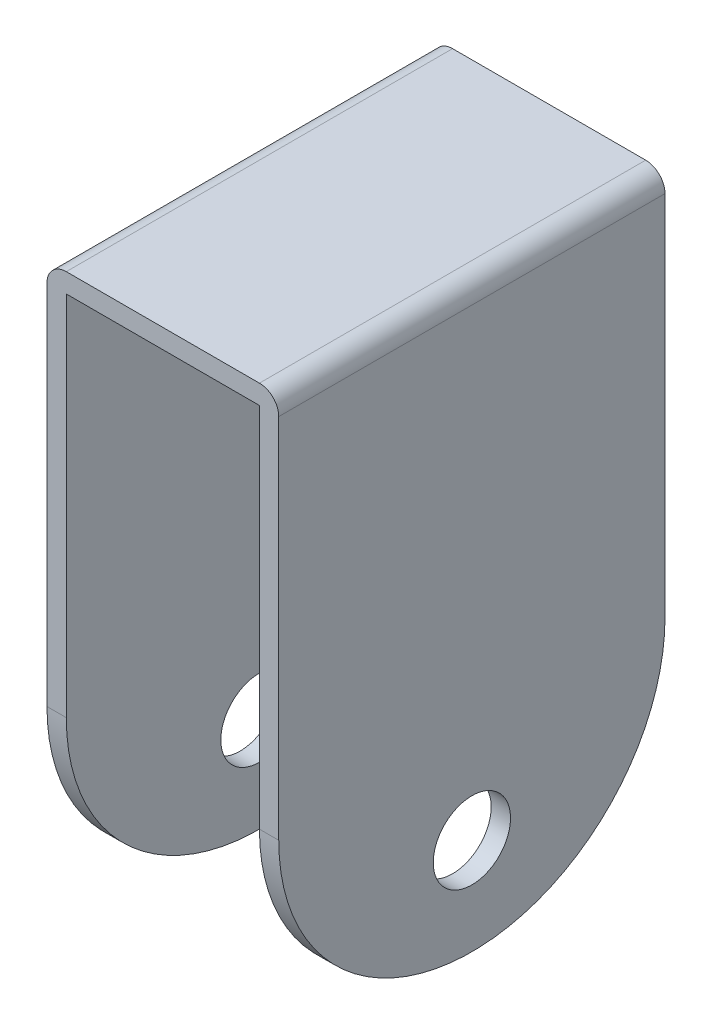
ISO-10303-21;
HEADER;
FILE_DESCRIPTION(('STEP AP214'),'2;1');
FILE_NAME('part.step','',(''),(''),'','','');
FILE_SCHEMA(('AUTOMOTIVE_DESIGN { 1 0 10303 214 1 1 1 1 }'));
ENDSEC;
DATA;
#1=APPLICATION_CONTEXT('core data for automotive mechanical design processes');
#2=APPLICATION_PROTOCOL_DEFINITION('international standard','automotive_design',2000,#1);
#3=PRODUCT_CONTEXT('',#1,'mechanical');
#4=PRODUCT('Part','Part','',(#3));
#5=PRODUCT_RELATED_PRODUCT_CATEGORY('part','',(#4));
#6=PRODUCT_DEFINITION_FORMATION('','',#4);
#7=PRODUCT_DEFINITION_CONTEXT('part definition',#1,'design');
#8=PRODUCT_DEFINITION('design','',#6,#7);
#9=PRODUCT_DEFINITION_SHAPE('','',#8);
#10=(LENGTH_UNIT() NAMED_UNIT(*) SI_UNIT(.MILLI.,.METRE.));
#11=(NAMED_UNIT(*) PLANE_ANGLE_UNIT() SI_UNIT($,.RADIAN.));
#12=(NAMED_UNIT(*) SI_UNIT($,.STERADIAN.) SOLID_ANGLE_UNIT());
#13=UNCERTAINTY_MEASURE_WITH_UNIT(LENGTH_MEASURE(1.E-05),#10,'distance_accuracy_value','');
#14=(GEOMETRIC_REPRESENTATION_CONTEXT(3) GLOBAL_UNCERTAINTY_ASSIGNED_CONTEXT((#13)) GLOBAL_UNIT_ASSIGNED_CONTEXT((#10,
#11,#12)) REPRESENTATION_CONTEXT('',''));
#15=CARTESIAN_POINT('',(0.,0.,0.));
#16=DIRECTION('',(0.,0.,1.));
#17=DIRECTION('',(1.,0.,0.));
#18=AXIS2_PLACEMENT_3D('',#15,#16,#17);
#19=CARTESIAN_POINT('',(-3.,0.,0.));
#20=DIRECTION('',(0.,0.,1.));
#21=DIRECTION('',(0.,-1.,0.));
#22=AXIS2_PLACEMENT_3D('',#19,#20,#21);
#23=PLANE('',#22);
#24=DIRECTION('',(0.,-1.,0.));
#25=VECTOR('',#24,1.);
#26=CARTESIAN_POINT('',(0.,0.,0.));
#27=LINE('',#26,#25);
#28=CARTESIAN_POINT('',(0.,-3.,0.));
#29=VERTEX_POINT('',#28);
#30=CARTESIAN_POINT('',(0.,-60.,0.));
#31=VERTEX_POINT('',#30);
#32=EDGE_CURVE('E155',#29,#31,#27,.T.);
#33=ORIENTED_EDGE('',*,*,#32,.F.);
#34=CARTESIAN_POINT('',(-3.,-3.,0.));
#35=DIRECTION('',(0.,0.,1.));
#36=DIRECTION('',(0.,-1.,0.));
#37=AXIS2_PLACEMENT_3D('',#34,#35,#36);
#38=CIRCLE('',#37,3.);
#39=CARTESIAN_POINT('',(-3.,0.,0.));
#40=VERTEX_POINT('',#39);
#41=EDGE_CURVE('E187',#29,#40,#38,.T.);
#42=ORIENTED_EDGE('',*,*,#41,.T.);
#43=DIRECTION('',(1.,0.,0.));
#44=VECTOR('',#43,1.);
#45=CARTESIAN_POINT('',(-3.,0.,0.));
#46=LINE('',#45,#44);
#47=CARTESIAN_POINT('',(-33.,0.,0.));
#48=VERTEX_POINT('',#47);
#49=EDGE_CURVE('E174',#48,#40,#46,.T.);
#50=ORIENTED_EDGE('',*,*,#49,.F.);
#51=CARTESIAN_POINT('',(-33.,-3.,0.));
#52=DIRECTION('',(0.,0.,1.));
#53=DIRECTION('',(0.,-1.,0.));
#54=AXIS2_PLACEMENT_3D('',#51,#52,#53);
#55=CIRCLE('',#54,3.);
#56=CARTESIAN_POINT('',(-36.,-3.,0.));
#57=VERTEX_POINT('',#56);
#58=EDGE_CURVE('E185',#48,#57,#55,.T.);
#59=ORIENTED_EDGE('',*,*,#58,.T.);
#60=DIRECTION('',(0.,1.,0.));
#61=VECTOR('',#60,1.);
#62=CARTESIAN_POINT('',(-36.,0.,0.));
#63=LINE('',#62,#61);
#64=CARTESIAN_POINT('',(-36.,-60.,0.));
#65=VERTEX_POINT('',#64);
#66=EDGE_CURVE('E128',#65,#57,#63,.T.);
#67=ORIENTED_EDGE('',*,*,#66,.F.);
#68=DIRECTION('',(1.,0.,0.));
#69=VECTOR('',#68,1.);
#70=CARTESIAN_POINT('',(-36.,-60.,0.));
#71=LINE('',#70,#69);
#72=CARTESIAN_POINT('',(-33.,-60.,0.));
#73=VERTEX_POINT('',#72);
#74=EDGE_CURVE('E126',#65,#73,#71,.T.);
#75=ORIENTED_EDGE('',*,*,#74,.T.);
#76=DIRECTION('',(0.,1.,0.));
#77=VECTOR('',#76,1.);
#78=CARTESIAN_POINT('',(-33.,0.,0.));
#79=LINE('',#78,#77);
#80=CARTESIAN_POINT('',(-33.,-3.,0.));
#81=VERTEX_POINT('',#80);
#82=EDGE_CURVE('E119',#73,#81,#79,.T.);
#83=ORIENTED_EDGE('',*,*,#82,.T.);
#84=DIRECTION('',(1.,0.,0.));
#85=VECTOR('',#84,1.);
#86=CARTESIAN_POINT('',(-33.,-3.,0.));
#87=LINE('',#86,#85);
#88=CARTESIAN_POINT('',(-3.,-3.,0.));
#89=VERTEX_POINT('',#88);
#90=EDGE_CURVE('E144',#81,#89,#87,.T.);
#91=ORIENTED_EDGE('',*,*,#90,.T.);
#92=DIRECTION('',(0.,-1.,0.));
#93=VECTOR('',#92,1.);
#94=CARTESIAN_POINT('',(-3.,0.,0.));
#95=LINE('',#94,#93);
#96=CARTESIAN_POINT('',(-3.,-60.,0.));
#97=VERTEX_POINT('',#96);
#98=EDGE_CURVE('E158',#89,#97,#95,.T.);
#99=ORIENTED_EDGE('',*,*,#98,.T.);
#100=DIRECTION('',(1.,0.,0.));
#101=VECTOR('',#100,1.);
#102=CARTESIAN_POINT('',(-3.,-60.,0.));
#103=LINE('',#102,#101);
#104=EDGE_CURVE('E167',#97,#31,#103,.T.);
#105=ORIENTED_EDGE('',*,*,#104,.T.);
#106=EDGE_LOOP('',(#33,#42,#50,#59,#67,#75,#83,#91,#99,#105));
#107=FACE_BOUND('',#106,.T.);
#108=ADVANCED_FACE('F32',(#107),#23,.T.);
#109=CARTESIAN_POINT('',(-3.,0.,0.));
#110=DIRECTION('',(0.,1.,0.));
#111=DIRECTION('',(0.,0.,1.));
#112=AXIS2_PLACEMENT_3D('',#109,#110,#111);
#113=PLANE('',#112);
#114=ORIENTED_EDGE('',*,*,#49,.T.);
#115=DIRECTION('',(0.,0.,1.));
#116=VECTOR('',#115,1.);
#117=CARTESIAN_POINT('',(-3.,0.,-60.));
#118=LINE('',#117,#116);
#119=CARTESIAN_POINT('',(-3.,0.,-60.));
#120=VERTEX_POINT('',#119);
#121=EDGE_CURVE('E54',#40,#120,#118,.F.);
#122=ORIENTED_EDGE('',*,*,#121,.T.);
#123=DIRECTION('',(1.,0.,0.));
#124=VECTOR('',#123,1.);
#125=CARTESIAN_POINT('',(-3.,0.,-60.));
#126=LINE('',#125,#124);
#127=CARTESIAN_POINT('',(-33.,0.,-60.));
#128=VERTEX_POINT('',#127);
#129=EDGE_CURVE('E177',#128,#120,#126,.T.);
#130=ORIENTED_EDGE('',*,*,#129,.F.);
#131=DIRECTION('',(0.,0.,-1.));
#132=VECTOR('',#131,1.);
#133=CARTESIAN_POINT('',(-33.,0.,0.));
#134=LINE('',#133,#132);
#135=EDGE_CURVE('E189',#128,#48,#134,.F.);
#136=ORIENTED_EDGE('',*,*,#135,.T.);
#137=EDGE_LOOP('',(#114,#122,#130,#136));
#138=FACE_BOUND('',#137,.T.);
#139=ADVANCED_FACE('F204',(#138),#113,.T.);
#140=CARTESIAN_POINT('',(-3.,0.,-60.));
#141=DIRECTION('',(0.,0.,-1.));
#142=DIRECTION('',(0.,1.,0.));
#143=AXIS2_PLACEMENT_3D('',#140,#141,#142);
#144=PLANE('',#143);
#145=ORIENTED_EDGE('',*,*,#129,.T.);
#146=CARTESIAN_POINT('',(-3.,-3.,-60.));
#147=DIRECTION('',(0.,0.,-1.));
#148=DIRECTION('',(0.,1.,0.));
#149=AXIS2_PLACEMENT_3D('',#146,#147,#148);
#150=CIRCLE('',#149,3.);
#151=CARTESIAN_POINT('',(0.,-3.,-60.));
#152=VERTEX_POINT('',#151);
#153=EDGE_CURVE('E40',#120,#152,#150,.T.);
#154=ORIENTED_EDGE('',*,*,#153,.T.);
#155=DIRECTION('',(0.,1.,0.));
#156=VECTOR('',#155,1.);
#157=CARTESIAN_POINT('',(0.,0.,-60.));
#158=LINE('',#157,#156);
#159=CARTESIAN_POINT('',(0.,-60.,-60.));
#160=VERTEX_POINT('',#159);
#161=EDGE_CURVE('E161',#160,#152,#158,.T.);
#162=ORIENTED_EDGE('',*,*,#161,.F.);
#163=DIRECTION('',(1.,0.,0.));
#164=VECTOR('',#163,1.);
#165=CARTESIAN_POINT('',(-3.,-60.,-60.));
#166=LINE('',#165,#164);
#167=CARTESIAN_POINT('',(-3.,-60.,-60.));
#168=VERTEX_POINT('',#167);
#169=EDGE_CURVE('E179',#168,#160,#166,.T.);
#170=ORIENTED_EDGE('',*,*,#169,.F.);
#171=DIRECTION('',(0.,1.,0.));
#172=VECTOR('',#171,1.);
#173=CARTESIAN_POINT('',(-3.,0.,-60.));
#174=LINE('',#173,#172);
#175=CARTESIAN_POINT('',(-3.,-3.,-60.));
#176=VERTEX_POINT('',#175);
#177=EDGE_CURVE('E164',#168,#176,#174,.T.);
#178=ORIENTED_EDGE('',*,*,#177,.T.);
#179=DIRECTION('',(1.,0.,0.));
#180=VECTOR('',#179,1.);
#181=CARTESIAN_POINT('',(-33.,-3.,-60.));
#182=LINE('',#181,#180);
#183=CARTESIAN_POINT('',(-33.,-3.,-60.));
#184=VERTEX_POINT('',#183);
#185=EDGE_CURVE('E148',#184,#176,#182,.T.);
#186=ORIENTED_EDGE('',*,*,#185,.F.);
#187=DIRECTION('',(0.,-1.,0.));
#188=VECTOR('',#187,1.);
#189=CARTESIAN_POINT('',(-33.,0.,-60.));
#190=LINE('',#189,#188);
#191=CARTESIAN_POINT('',(-33.,-60.,-60.));
#192=VERTEX_POINT('',#191);
#193=EDGE_CURVE('E133',#184,#192,#190,.T.);
#194=ORIENTED_EDGE('',*,*,#193,.T.);
#195=DIRECTION('',(1.,0.,0.));
#196=VECTOR('',#195,1.);
#197=CARTESIAN_POINT('',(-36.,-60.,-60.));
#198=LINE('',#197,#196);
#199=CARTESIAN_POINT('',(-36.,-60.,-60.));
#200=VERTEX_POINT('',#199);
#201=EDGE_CURVE('E124',#200,#192,#198,.T.);
#202=ORIENTED_EDGE('',*,*,#201,.F.);
#203=DIRECTION('',(0.,-1.,0.));
#204=VECTOR('',#203,1.);
#205=CARTESIAN_POINT('',(-36.,0.,-60.));
#206=LINE('',#205,#204);
#207=CARTESIAN_POINT('',(-36.,-3.,-60.));
#208=VERTEX_POINT('',#207);
#209=EDGE_CURVE('E110',#208,#200,#206,.T.);
#210=ORIENTED_EDGE('',*,*,#209,.F.);
#211=CARTESIAN_POINT('',(-33.,-3.,-60.));
#212=DIRECTION('',(0.,0.,-1.));
#213=DIRECTION('',(0.,1.,0.));
#214=AXIS2_PLACEMENT_3D('',#211,#212,#213);
#215=CIRCLE('',#214,3.);
#216=EDGE_CURVE('E47',#208,#128,#215,.T.);
#217=ORIENTED_EDGE('',*,*,#216,.T.);
#218=EDGE_LOOP('',(#145,#154,#162,#170,#178,#186,#194,#202,#210,#217));
#219=FACE_BOUND('',#218,.T.);
#220=ADVANCED_FACE('F130',(#219),#144,.T.);
#221=CARTESIAN_POINT('',(-3.,-60.,-30.));
#222=DIRECTION('',(1.,0.,0.));
#223=DIRECTION('',(0.,0.,-1.));
#224=AXIS2_PLACEMENT_3D('',#221,#222,#223);
#225=CYLINDRICAL_SURFACE('',#224,30.);
#226=CARTESIAN_POINT('',(0.,-60.,-30.));
#227=DIRECTION('',(1.,0.,0.));
#228=DIRECTION('',(0.,0.,1.));
#229=AXIS2_PLACEMENT_3D('',#226,#227,#228);
#230=CIRCLE('',#229,30.);
#231=EDGE_CURVE('E169',#31,#160,#230,.T.);
#232=ORIENTED_EDGE('',*,*,#231,.F.);
#233=ORIENTED_EDGE('',*,*,#104,.F.);
#234=CARTESIAN_POINT('',(-3.,-60.,-30.));
#235=DIRECTION('',(1.,0.,0.));
#236=DIRECTION('',(0.,0.,1.));
#237=AXIS2_PLACEMENT_3D('',#234,#235,#236);
#238=CIRCLE('',#237,30.);
#239=EDGE_CURVE('E160',#97,#168,#238,.T.);
#240=ORIENTED_EDGE('',*,*,#239,.T.);
#241=ORIENTED_EDGE('',*,*,#169,.T.);
#242=EDGE_LOOP('',(#232,#233,#240,#241));
#243=FACE_BOUND('',#242,.T.);
#244=ADVANCED_FACE('F224',(#243),#225,.T.);
#245=CARTESIAN_POINT('',(-3.,-60.,-30.));
#246=DIRECTION('',(-1.,0.,0.));
#247=DIRECTION('',(0.,0.,1.));
#248=AXIS2_PLACEMENT_3D('',#245,#246,#247);
#249=PLANE('',#248);
#250=DIRECTION('',(0.,0.,1.));
#251=VECTOR('',#250,1.);
#252=CARTESIAN_POINT('',(-3.,-3.,-60.));
#253=LINE('',#252,#251);
#254=EDGE_CURVE('E135',#176,#89,#253,.T.);
#255=ORIENTED_EDGE('',*,*,#254,.F.);
#256=ORIENTED_EDGE('',*,*,#177,.F.);
#257=ORIENTED_EDGE('',*,*,#239,.F.);
#258=ORIENTED_EDGE('',*,*,#98,.F.);
#259=EDGE_LOOP('',(#255,#256,#257,#258));
#260=FACE_BOUND('',#259,.T.);
#261=CARTESIAN_POINT('',(-3.,-75.,-30.));
#262=DIRECTION('',(1.,0.,0.));
#263=DIRECTION('',(0.,0.,-1.));
#264=AXIS2_PLACEMENT_3D('',#261,#262,#263);
#265=CIRCLE('',#264,6.);
#266=CARTESIAN_POINT('',(-3.,-75.,-36.));
#267=VERTEX_POINT('',#266);
#268=EDGE_CURVE('E152',#267,#267,#265,.T.);
#269=ORIENTED_EDGE('',*,*,#268,.T.);
#270=EDGE_LOOP('',(#269));
#271=FACE_BOUND('',#270,.T.);
#272=ADVANCED_FACE('F220',(#260,#271),#249,.T.);
#273=CARTESIAN_POINT('',(0.,-60.,-30.));
#274=DIRECTION('',(-1.,0.,0.));
#275=DIRECTION('',(0.,0.,1.));
#276=AXIS2_PLACEMENT_3D('',#273,#274,#275);
#277=PLANE('',#276);
#278=CARTESIAN_POINT('',(0.,-75.,-30.));
#279=DIRECTION('',(1.,0.,0.));
#280=DIRECTION('',(0.,0.,-1.));
#281=AXIS2_PLACEMENT_3D('',#278,#279,#280);
#282=CIRCLE('',#281,6.);
#283=CARTESIAN_POINT('',(0.,-75.,-36.));
#284=VERTEX_POINT('',#283);
#285=EDGE_CURVE('E151',#284,#284,#282,.T.);
#286=ORIENTED_EDGE('',*,*,#285,.F.);
#287=EDGE_LOOP('',(#286));
#288=FACE_BOUND('',#287,.T.);
#289=ORIENTED_EDGE('',*,*,#161,.T.);
#290=DIRECTION('',(0.,0.,1.));
#291=VECTOR('',#290,1.);
#292=CARTESIAN_POINT('',(0.,-3.,0.));
#293=LINE('',#292,#291);
#294=EDGE_CURVE('E176',#152,#29,#293,.T.);
#295=ORIENTED_EDGE('',*,*,#294,.T.);
#296=ORIENTED_EDGE('',*,*,#32,.T.);
#297=ORIENTED_EDGE('',*,*,#231,.T.);
#298=EDGE_LOOP('',(#289,#295,#296,#297));
#299=FACE_BOUND('',#298,.T.);
#300=ADVANCED_FACE('F197',(#288,#299),#277,.F.);
#301=CARTESIAN_POINT('',(-3.,-75.,-30.));
#302=DIRECTION('',(1.,0.,0.));
#303=DIRECTION('',(0.,0.,-1.));
#304=AXIS2_PLACEMENT_3D('',#301,#302,#303);
#305=CYLINDRICAL_SURFACE('',#304,6.);
#306=ORIENTED_EDGE('',*,*,#268,.F.);
#307=EDGE_LOOP('',(#306));
#308=FACE_BOUND('',#307,.T.);
#309=ORIENTED_EDGE('',*,*,#285,.T.);
#310=EDGE_LOOP('',(#309));
#311=FACE_BOUND('',#310,.T.);
#312=ADVANCED_FACE('F260',(#308,#311),#305,.F.);
#313=CARTESIAN_POINT('',(-33.,-3.,-60.));
#314=DIRECTION('',(0.,1.,0.));
#315=DIRECTION('',(0.,0.,1.));
#316=AXIS2_PLACEMENT_3D('',#313,#314,#315);
#317=PLANE('',#316);
#318=ORIENTED_EDGE('',*,*,#254,.T.);
#319=ORIENTED_EDGE('',*,*,#90,.F.);
#320=DIRECTION('',(0.,0.,1.));
#321=VECTOR('',#320,1.);
#322=CARTESIAN_POINT('',(-33.,-3.,-60.));
#323=LINE('',#322,#321);
#324=EDGE_CURVE('E138',#184,#81,#323,.T.);
#325=ORIENTED_EDGE('',*,*,#324,.F.);
#326=ORIENTED_EDGE('',*,*,#185,.T.);
#327=EDGE_LOOP('',(#318,#319,#325,#326));
#328=FACE_BOUND('',#327,.T.);
#329=ADVANCED_FACE('F216',(#328),#317,.F.);
#330=CARTESIAN_POINT('',(-36.,-60.,-30.));
#331=DIRECTION('',(1.,0.,0.));
#332=DIRECTION('',(0.,0.,-1.));
#333=AXIS2_PLACEMENT_3D('',#330,#331,#332);
#334=PLANE('',#333);
#335=ORIENTED_EDGE('',*,*,#66,.T.);
#336=DIRECTION('',(0.,0.,-1.));
#337=VECTOR('',#336,1.);
#338=CARTESIAN_POINT('',(-36.,-3.,-60.));
#339=LINE('',#338,#337);
#340=EDGE_CURVE('E11',#57,#208,#339,.T.);
#341=ORIENTED_EDGE('',*,*,#340,.T.);
#342=ORIENTED_EDGE('',*,*,#209,.T.);
#343=CARTESIAN_POINT('',(-36.,-60.,-30.));
#344=DIRECTION('',(-1.,0.,0.));
#345=DIRECTION('',(0.,0.,-1.));
#346=AXIS2_PLACEMENT_3D('',#343,#344,#345);
#347=CIRCLE('',#346,30.);
#348=EDGE_CURVE('E115',#200,#65,#347,.T.);
#349=ORIENTED_EDGE('',*,*,#348,.T.);
#350=EDGE_LOOP('',(#335,#341,#342,#349));
#351=FACE_BOUND('',#350,.T.);
#352=CARTESIAN_POINT('',(-36.,-75.,-30.));
#353=DIRECTION('',(-1.,0.,0.));
#354=DIRECTION('',(0.,0.,1.));
#355=AXIS2_PLACEMENT_3D('',#352,#353,#354);
#356=CIRCLE('',#355,6.00000000000001);
#357=CARTESIAN_POINT('',(-36.,-75.,-24.));
#358=VERTEX_POINT('',#357);
#359=EDGE_CURVE('E209',#358,#358,#356,.T.);
#360=ORIENTED_EDGE('',*,*,#359,.F.);
#361=EDGE_LOOP('',(#360));
#362=FACE_BOUND('',#361,.T.);
#363=ADVANCED_FACE('F113',(#351,#362),#334,.F.);
#364=CARTESIAN_POINT('',(-33.,-60.,-30.));
#365=DIRECTION('',(1.,0.,0.));
#366=DIRECTION('',(0.,0.,-1.));
#367=AXIS2_PLACEMENT_3D('',#364,#365,#366);
#368=PLANE('',#367);
#369=ORIENTED_EDGE('',*,*,#193,.F.);
#370=ORIENTED_EDGE('',*,*,#324,.T.);
#371=ORIENTED_EDGE('',*,*,#82,.F.);
#372=CARTESIAN_POINT('',(-33.,-60.,-30.));
#373=DIRECTION('',(-1.,0.,0.));
#374=DIRECTION('',(0.,0.,-1.));
#375=AXIS2_PLACEMENT_3D('',#372,#373,#374);
#376=CIRCLE('',#375,30.);
#377=EDGE_CURVE('E208',#192,#73,#376,.T.);
#378=ORIENTED_EDGE('',*,*,#377,.F.);
#379=EDGE_LOOP('',(#369,#370,#371,#378));
#380=FACE_BOUND('',#379,.T.);
#381=CARTESIAN_POINT('',(-33.,-75.,-30.));
#382=DIRECTION('',(-1.,0.,0.));
#383=DIRECTION('',(0.,0.,1.));
#384=AXIS2_PLACEMENT_3D('',#381,#382,#383);
#385=CIRCLE('',#384,6.00000000000001);
#386=CARTESIAN_POINT('',(-33.,-75.,-24.));
#387=VERTEX_POINT('',#386);
#388=EDGE_CURVE('E366',#387,#387,#385,.T.);
#389=ORIENTED_EDGE('',*,*,#388,.T.);
#390=EDGE_LOOP('',(#389));
#391=FACE_BOUND('',#390,.T.);
#392=ADVANCED_FACE('F213',(#380,#391),#368,.T.);
#393=CARTESIAN_POINT('',(-36.,-60.,-30.));
#394=DIRECTION('',(1.,0.,0.));
#395=DIRECTION('',(0.,0.,-1.));
#396=AXIS2_PLACEMENT_3D('',#393,#394,#395);
#397=CYLINDRICAL_SURFACE('',#396,30.);
#398=ORIENTED_EDGE('',*,*,#377,.T.);
#399=ORIENTED_EDGE('',*,*,#74,.F.);
#400=ORIENTED_EDGE('',*,*,#348,.F.);
#401=ORIENTED_EDGE('',*,*,#201,.T.);
#402=EDGE_LOOP('',(#398,#399,#400,#401));
#403=FACE_BOUND('',#402,.T.);
#404=ADVANCED_FACE('F123',(#403),#397,.T.);
#405=CARTESIAN_POINT('',(-36.,-75.,-30.));
#406=DIRECTION('',(1.,0.,0.));
#407=DIRECTION('',(0.,0.,-1.));
#408=AXIS2_PLACEMENT_3D('',#405,#406,#407);
#409=CYLINDRICAL_SURFACE('',#408,6.00000000000001);
#410=ORIENTED_EDGE('',*,*,#359,.T.);
#411=EDGE_LOOP('',(#410));
#412=FACE_BOUND('',#411,.T.);
#413=ORIENTED_EDGE('',*,*,#388,.F.);
#414=EDGE_LOOP('',(#413));
#415=FACE_BOUND('',#414,.T.);
#416=ADVANCED_FACE('F240',(#412,#415),#409,.F.);
#417=CARTESIAN_POINT('',(-3.,-3.,-30.));
#418=DIRECTION('',(0.,0.,-1.));
#419=DIRECTION('',(-1.,0.,0.));
#420=AXIS2_PLACEMENT_3D('',#417,#418,#419);
#421=CYLINDRICAL_SURFACE('',#420,3.);
#422=ORIENTED_EDGE('',*,*,#153,.F.);
#423=ORIENTED_EDGE('',*,*,#121,.F.);
#424=ORIENTED_EDGE('',*,*,#41,.F.);
#425=ORIENTED_EDGE('',*,*,#294,.F.);
#426=EDGE_LOOP('',(#422,#423,#424,#425));
#427=FACE_BOUND('',#426,.T.);
#428=ADVANCED_FACE('F200',(#427),#421,.T.);
#429=CARTESIAN_POINT('',(-33.,-3.,-30.));
#430=DIRECTION('',(0.,0.,1.));
#431=DIRECTION('',(1.,0.,0.));
#432=AXIS2_PLACEMENT_3D('',#429,#430,#431);
#433=CYLINDRICAL_SURFACE('',#432,3.);
#434=ORIENTED_EDGE('',*,*,#58,.F.);
#435=ORIENTED_EDGE('',*,*,#135,.F.);
#436=ORIENTED_EDGE('',*,*,#216,.F.);
#437=ORIENTED_EDGE('',*,*,#340,.F.);
#438=EDGE_LOOP('',(#434,#435,#436,#437));
#439=FACE_BOUND('',#438,.T.);
#440=ADVANCED_FACE('F34',(#439),#433,.T.);
#441=CLOSED_SHELL('',(#108,#139,#220,#244,#272,#300,#312,#329,#363,#392,#404,#416,#428,#440));
#442=MANIFOLD_SOLID_BREP('B2',#441);
#443=ADVANCED_BREP_SHAPE_REPRESENTATION('',(#18,#442),#14);
#444=SHAPE_DEFINITION_REPRESENTATION(#9,#443);
ENDSEC;
END-ISO-10303-21;
